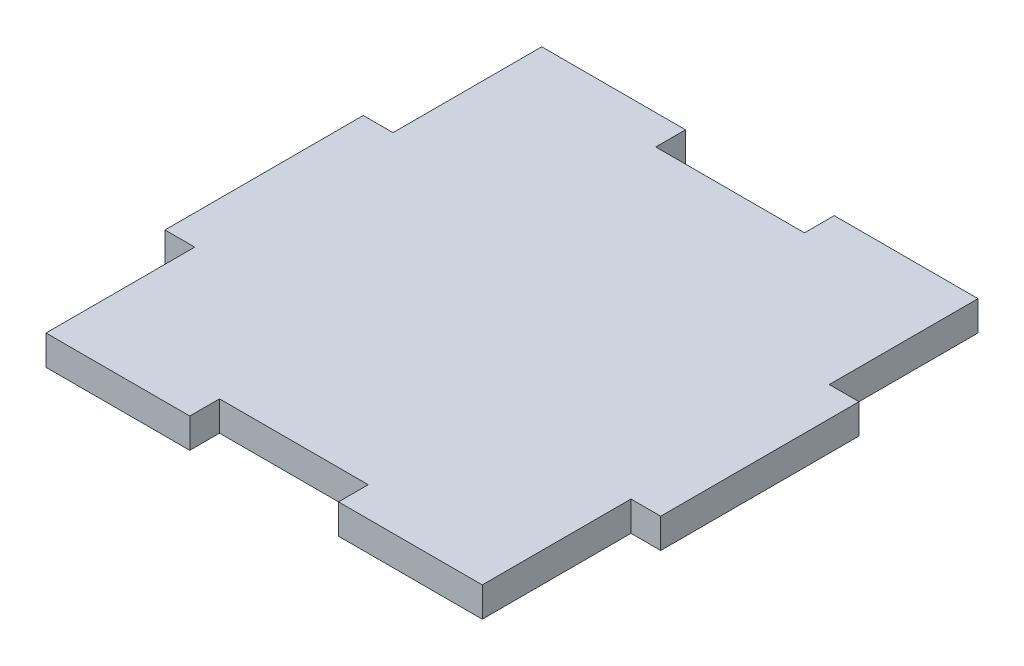
ISO-10303-21;
HEADER;
FILE_DESCRIPTION(('STEP AP214'),'2;1');
FILE_NAME('part.step','',(''),(''),'','','');
FILE_SCHEMA(('AUTOMOTIVE_DESIGN { 1 0 10303 214 1 1 1 1 }'));
ENDSEC;
DATA;
#1=APPLICATION_CONTEXT('core data for automotive mechanical design processes');
#2=APPLICATION_PROTOCOL_DEFINITION('international standard','automotive_design',2000,#1);
#3=PRODUCT_CONTEXT('',#1,'mechanical');
#4=PRODUCT('Part','Part','',(#3));
#5=PRODUCT_RELATED_PRODUCT_CATEGORY('part','',(#4));
#6=PRODUCT_DEFINITION_FORMATION('','',#4);
#7=PRODUCT_DEFINITION_CONTEXT('part definition',#1,'design');
#8=PRODUCT_DEFINITION('design','',#6,#7);
#9=PRODUCT_DEFINITION_SHAPE('','',#8);
#10=(LENGTH_UNIT() NAMED_UNIT(*) SI_UNIT(.MILLI.,.METRE.));
#11=(NAMED_UNIT(*) PLANE_ANGLE_UNIT() SI_UNIT($,.RADIAN.));
#12=(NAMED_UNIT(*) SI_UNIT($,.STERADIAN.) SOLID_ANGLE_UNIT());
#13=UNCERTAINTY_MEASURE_WITH_UNIT(LENGTH_MEASURE(1.E-05),#10,'distance_accuracy_value','');
#14=(GEOMETRIC_REPRESENTATION_CONTEXT(3) GLOBAL_UNCERTAINTY_ASSIGNED_CONTEXT((#13)) GLOBAL_UNIT_ASSIGNED_CONTEXT((#10,
#11,#12)) REPRESENTATION_CONTEXT('',''));
#15=CARTESIAN_POINT('',(0.,0.,0.));
#16=DIRECTION('',(0.,0.,1.));
#17=DIRECTION('',(1.,0.,0.));
#18=AXIS2_PLACEMENT_3D('',#15,#16,#17);
#19=CARTESIAN_POINT('',(22.,3.,-25.));
#20=DIRECTION('',(0.,0.,1.));
#21=DIRECTION('',(1.,0.,0.));
#22=AXIS2_PLACEMENT_3D('',#19,#20,#21);
#23=PLANE('',#22);
#24=DIRECTION('',(-1.,0.,0.));
#25=VECTOR('',#24,1.);
#26=CARTESIAN_POINT('',(22.,0.,-25.));
#27=LINE('',#26,#25);
#28=CARTESIAN_POINT('',(22.,0.,-25.));
#29=VERTEX_POINT('',#28);
#30=CARTESIAN_POINT('',(7.5,0.,-25.));
#31=VERTEX_POINT('',#30);
#32=EDGE_CURVE('E203',#29,#31,#27,.T.);
#33=ORIENTED_EDGE('',*,*,#32,.T.);
#34=DIRECTION('',(0.,-1.,0.));
#35=VECTOR('',#34,1.);
#36=CARTESIAN_POINT('',(7.5,3.,-25.));
#37=LINE('',#36,#35);
#38=CARTESIAN_POINT('',(7.5,3.,-25.));
#39=VERTEX_POINT('',#38);
#40=EDGE_CURVE('E11',#39,#31,#37,.T.);
#41=ORIENTED_EDGE('',*,*,#40,.F.);
#42=DIRECTION('',(-1.,0.,0.));
#43=VECTOR('',#42,1.);
#44=CARTESIAN_POINT('',(22.,3.,-25.));
#45=LINE('',#44,#43);
#46=CARTESIAN_POINT('',(22.,3.,-25.));
#47=VERTEX_POINT('',#46);
#48=EDGE_CURVE('E241',#47,#39,#45,.T.);
#49=ORIENTED_EDGE('',*,*,#48,.F.);
#50=DIRECTION('',(0.,-1.,0.));
#51=VECTOR('',#50,1.);
#52=CARTESIAN_POINT('',(22.,3.,-25.));
#53=LINE('',#52,#51);
#54=EDGE_CURVE('E199',#47,#29,#53,.T.);
#55=ORIENTED_EDGE('',*,*,#54,.T.);
#56=EDGE_LOOP('',(#33,#41,#49,#55));
#57=FACE_BOUND('',#56,.T.);
#58=ADVANCED_FACE('F35',(#57),#23,.F.);
#59=CARTESIAN_POINT('',(7.5,3.,-25.));
#60=DIRECTION('',(1.,0.,0.));
#61=DIRECTION('',(0.,0.,-1.));
#62=AXIS2_PLACEMENT_3D('',#59,#60,#61);
#63=PLANE('',#62);
#64=DIRECTION('',(0.,0.,1.));
#65=VECTOR('',#64,1.);
#66=CARTESIAN_POINT('',(7.5,0.,-25.));
#67=LINE('',#66,#65);
#68=CARTESIAN_POINT('',(7.5,0.,-22.));
#69=VERTEX_POINT('',#68);
#70=EDGE_CURVE('E206',#31,#69,#67,.T.);
#71=ORIENTED_EDGE('',*,*,#70,.T.);
#72=DIRECTION('',(0.,-1.,0.));
#73=VECTOR('',#72,1.);
#74=CARTESIAN_POINT('',(7.5,3.,-22.));
#75=LINE('',#74,#73);
#76=CARTESIAN_POINT('',(7.5,3.,-22.));
#77=VERTEX_POINT('',#76);
#78=EDGE_CURVE('E43',#77,#69,#75,.T.);
#79=ORIENTED_EDGE('',*,*,#78,.F.);
#80=DIRECTION('',(0.,0.,1.));
#81=VECTOR('',#80,1.);
#82=CARTESIAN_POINT('',(7.5,3.,-25.));
#83=LINE('',#82,#81);
#84=EDGE_CURVE('E130',#39,#77,#83,.T.);
#85=ORIENTED_EDGE('',*,*,#84,.F.);
#86=ORIENTED_EDGE('',*,*,#40,.T.);
#87=EDGE_LOOP('',(#71,#79,#85,#86));
#88=FACE_BOUND('',#87,.T.);
#89=ADVANCED_FACE('F359',(#88),#63,.F.);
#90=CARTESIAN_POINT('',(7.5,3.,-22.));
#91=DIRECTION('',(0.,0.,1.));
#92=DIRECTION('',(1.,0.,0.));
#93=AXIS2_PLACEMENT_3D('',#90,#91,#92);
#94=PLANE('',#93);
#95=DIRECTION('',(-1.,0.,0.));
#96=VECTOR('',#95,1.);
#97=CARTESIAN_POINT('',(7.5,0.,-22.));
#98=LINE('',#97,#96);
#99=CARTESIAN_POINT('',(-7.5,0.,-22.));
#100=VERTEX_POINT('',#99);
#101=EDGE_CURVE('E208',#69,#100,#98,.T.);
#102=ORIENTED_EDGE('',*,*,#101,.T.);
#103=DIRECTION('',(0.,-1.,0.));
#104=VECTOR('',#103,1.);
#105=CARTESIAN_POINT('',(-7.5,3.,-22.));
#106=LINE('',#105,#104);
#107=CARTESIAN_POINT('',(-7.5,3.,-22.));
#108=VERTEX_POINT('',#107);
#109=EDGE_CURVE('E284',#108,#100,#106,.T.);
#110=ORIENTED_EDGE('',*,*,#109,.F.);
#111=DIRECTION('',(-1.,0.,0.));
#112=VECTOR('',#111,1.);
#113=CARTESIAN_POINT('',(7.5,3.,-22.));
#114=LINE('',#113,#112);
#115=EDGE_CURVE('E292',#77,#108,#114,.T.);
#116=ORIENTED_EDGE('',*,*,#115,.F.);
#117=ORIENTED_EDGE('',*,*,#78,.T.);
#118=EDGE_LOOP('',(#102,#110,#116,#117));
#119=FACE_BOUND('',#118,.T.);
#120=ADVANCED_FACE('F290',(#119),#94,.F.);
#121=CARTESIAN_POINT('',(-7.5,3.,-25.));
#122=DIRECTION('',(-1.,0.,0.));
#123=DIRECTION('',(0.,0.,1.));
#124=AXIS2_PLACEMENT_3D('',#121,#122,#123);
#125=PLANE('',#124);
#126=DIRECTION('',(0.,0.,-1.));
#127=VECTOR('',#126,1.);
#128=CARTESIAN_POINT('',(-7.5,0.,-25.));
#129=LINE('',#128,#127);
#130=CARTESIAN_POINT('',(-7.5,0.,-25.));
#131=VERTEX_POINT('',#130);
#132=EDGE_CURVE('E210',#100,#131,#129,.T.);
#133=ORIENTED_EDGE('',*,*,#132,.T.);
#134=DIRECTION('',(0.,-1.,0.));
#135=VECTOR('',#134,1.);
#136=CARTESIAN_POINT('',(-7.5,3.,-25.));
#137=LINE('',#136,#135);
#138=CARTESIAN_POINT('',(-7.5,3.,-25.));
#139=VERTEX_POINT('',#138);
#140=EDGE_CURVE('E281',#139,#131,#137,.T.);
#141=ORIENTED_EDGE('',*,*,#140,.F.);
#142=DIRECTION('',(0.,0.,-1.));
#143=VECTOR('',#142,1.);
#144=CARTESIAN_POINT('',(-7.5,3.,-25.));
#145=LINE('',#144,#143);
#146=EDGE_CURVE('E310',#108,#139,#145,.T.);
#147=ORIENTED_EDGE('',*,*,#146,.F.);
#148=ORIENTED_EDGE('',*,*,#109,.T.);
#149=EDGE_LOOP('',(#133,#141,#147,#148));
#150=FACE_BOUND('',#149,.T.);
#151=ADVANCED_FACE('F301',(#150),#125,.F.);
#152=CARTESIAN_POINT('',(-22.,3.,-25.));
#153=DIRECTION('',(0.,0.,1.));
#154=DIRECTION('',(1.,0.,0.));
#155=AXIS2_PLACEMENT_3D('',#152,#153,#154);
#156=PLANE('',#155);
#157=DIRECTION('',(-1.,0.,0.));
#158=VECTOR('',#157,1.);
#159=CARTESIAN_POINT('',(-22.,0.,-25.));
#160=LINE('',#159,#158);
#161=CARTESIAN_POINT('',(-22.,0.,-25.));
#162=VERTEX_POINT('',#161);
#163=EDGE_CURVE('E212',#131,#162,#160,.T.);
#164=ORIENTED_EDGE('',*,*,#163,.T.);
#165=DIRECTION('',(0.,-1.,0.));
#166=VECTOR('',#165,1.);
#167=CARTESIAN_POINT('',(-22.,3.,-25.));
#168=LINE('',#167,#166);
#169=CARTESIAN_POINT('',(-22.,3.,-25.));
#170=VERTEX_POINT('',#169);
#171=EDGE_CURVE('E278',#170,#162,#168,.T.);
#172=ORIENTED_EDGE('',*,*,#171,.F.);
#173=DIRECTION('',(-1.,0.,0.));
#174=VECTOR('',#173,1.);
#175=CARTESIAN_POINT('',(-22.,3.,-25.));
#176=LINE('',#175,#174);
#177=EDGE_CURVE('E307',#139,#170,#176,.T.);
#178=ORIENTED_EDGE('',*,*,#177,.F.);
#179=ORIENTED_EDGE('',*,*,#140,.T.);
#180=EDGE_LOOP('',(#164,#172,#178,#179));
#181=FACE_BOUND('',#180,.T.);
#182=ADVANCED_FACE('F305',(#181),#156,.F.);
#183=CARTESIAN_POINT('',(-22.,3.,-25.));
#184=DIRECTION('',(1.,0.,0.));
#185=DIRECTION('',(0.,0.,-1.));
#186=AXIS2_PLACEMENT_3D('',#183,#184,#185);
#187=PLANE('',#186);
#188=DIRECTION('',(0.,0.,1.));
#189=VECTOR('',#188,1.);
#190=CARTESIAN_POINT('',(-22.,0.,-25.));
#191=LINE('',#190,#189);
#192=CARTESIAN_POINT('',(-22.,0.,-10.));
#193=VERTEX_POINT('',#192);
#194=EDGE_CURVE('E214',#162,#193,#191,.T.);
#195=ORIENTED_EDGE('',*,*,#194,.T.);
#196=DIRECTION('',(0.,-1.,0.));
#197=VECTOR('',#196,1.);
#198=CARTESIAN_POINT('',(-22.,3.,-10.));
#199=LINE('',#198,#197);
#200=CARTESIAN_POINT('',(-22.,3.,-10.));
#201=VERTEX_POINT('',#200);
#202=EDGE_CURVE('E275',#201,#193,#199,.T.);
#203=ORIENTED_EDGE('',*,*,#202,.F.);
#204=DIRECTION('',(0.,0.,1.));
#205=VECTOR('',#204,1.);
#206=CARTESIAN_POINT('',(-22.,3.,-25.));
#207=LINE('',#206,#205);
#208=EDGE_CURVE('E309',#170,#201,#207,.T.);
#209=ORIENTED_EDGE('',*,*,#208,.F.);
#210=ORIENTED_EDGE('',*,*,#171,.T.);
#211=EDGE_LOOP('',(#195,#203,#209,#210));
#212=FACE_BOUND('',#211,.T.);
#213=ADVANCED_FACE('F372',(#212),#187,.F.);
#214=CARTESIAN_POINT('',(-22.,3.,-10.));
#215=DIRECTION('',(0.,0.,1.));
#216=DIRECTION('',(1.,0.,0.));
#217=AXIS2_PLACEMENT_3D('',#214,#215,#216);
#218=PLANE('',#217);
#219=DIRECTION('',(-1.,0.,0.));
#220=VECTOR('',#219,1.);
#221=CARTESIAN_POINT('',(-22.,0.,-10.));
#222=LINE('',#221,#220);
#223=CARTESIAN_POINT('',(-25.,0.,-9.99999999999999));
#224=VERTEX_POINT('',#223);
#225=EDGE_CURVE('E216',#193,#224,#222,.T.);
#226=ORIENTED_EDGE('',*,*,#225,.T.);
#227=DIRECTION('',(0.,-1.,0.));
#228=VECTOR('',#227,1.);
#229=CARTESIAN_POINT('',(-25.,3.,-9.99999999999999));
#230=LINE('',#229,#228);
#231=CARTESIAN_POINT('',(-25.,3.,-9.99999999999999));
#232=VERTEX_POINT('',#231);
#233=EDGE_CURVE('E272',#232,#224,#230,.T.);
#234=ORIENTED_EDGE('',*,*,#233,.F.);
#235=DIRECTION('',(-1.,0.,0.));
#236=VECTOR('',#235,1.);
#237=CARTESIAN_POINT('',(-22.,3.,-10.));
#238=LINE('',#237,#236);
#239=EDGE_CURVE('E312',#201,#232,#238,.T.);
#240=ORIENTED_EDGE('',*,*,#239,.F.);
#241=ORIENTED_EDGE('',*,*,#202,.T.);
#242=EDGE_LOOP('',(#226,#234,#240,#241));
#243=FACE_BOUND('',#242,.T.);
#244=ADVANCED_FACE('F375',(#243),#218,.F.);
#245=CARTESIAN_POINT('',(-25.,3.,-9.99999999999999));
#246=DIRECTION('',(1.,0.,0.));
#247=DIRECTION('',(0.,0.,-1.));
#248=AXIS2_PLACEMENT_3D('',#245,#246,#247);
#249=PLANE('',#248);
#250=DIRECTION('',(0.,0.,1.));
#251=VECTOR('',#250,1.);
#252=CARTESIAN_POINT('',(-25.,0.,-9.99999999999999));
#253=LINE('',#252,#251);
#254=CARTESIAN_POINT('',(-25.,0.,9.99999999999999));
#255=VERTEX_POINT('',#254);
#256=EDGE_CURVE('E218',#224,#255,#253,.T.);
#257=ORIENTED_EDGE('',*,*,#256,.T.);
#258=DIRECTION('',(0.,-1.,0.));
#259=VECTOR('',#258,1.);
#260=CARTESIAN_POINT('',(-25.,3.,9.99999999999999));
#261=LINE('',#260,#259);
#262=CARTESIAN_POINT('',(-25.,3.,9.99999999999999));
#263=VERTEX_POINT('',#262);
#264=EDGE_CURVE('E269',#263,#255,#261,.T.);
#265=ORIENTED_EDGE('',*,*,#264,.F.);
#266=DIRECTION('',(0.,0.,1.));
#267=VECTOR('',#266,1.);
#268=CARTESIAN_POINT('',(-25.,3.,-9.99999999999999));
#269=LINE('',#268,#267);
#270=EDGE_CURVE('E318',#232,#263,#269,.T.);
#271=ORIENTED_EDGE('',*,*,#270,.F.);
#272=ORIENTED_EDGE('',*,*,#233,.T.);
#273=EDGE_LOOP('',(#257,#265,#271,#272));
#274=FACE_BOUND('',#273,.T.);
#275=ADVANCED_FACE('F379',(#274),#249,.F.);
#276=CARTESIAN_POINT('',(-22.,3.,10.));
#277=DIRECTION('',(0.,0.,-1.));
#278=DIRECTION('',(-1.,0.,0.));
#279=AXIS2_PLACEMENT_3D('',#276,#277,#278);
#280=PLANE('',#279);
#281=DIRECTION('',(1.,0.,0.));
#282=VECTOR('',#281,1.);
#283=CARTESIAN_POINT('',(-22.,0.,10.));
#284=LINE('',#283,#282);
#285=CARTESIAN_POINT('',(-22.,0.,10.));
#286=VERTEX_POINT('',#285);
#287=EDGE_CURVE('E220',#255,#286,#284,.T.);
#288=ORIENTED_EDGE('',*,*,#287,.T.);
#289=DIRECTION('',(0.,-1.,0.));
#290=VECTOR('',#289,1.);
#291=CARTESIAN_POINT('',(-22.,3.,10.));
#292=LINE('',#291,#290);
#293=CARTESIAN_POINT('',(-22.,3.,10.));
#294=VERTEX_POINT('',#293);
#295=EDGE_CURVE('E266',#294,#286,#292,.T.);
#296=ORIENTED_EDGE('',*,*,#295,.F.);
#297=DIRECTION('',(1.,0.,0.));
#298=VECTOR('',#297,1.);
#299=CARTESIAN_POINT('',(-22.,3.,10.));
#300=LINE('',#299,#298);
#301=EDGE_CURVE('E320',#263,#294,#300,.T.);
#302=ORIENTED_EDGE('',*,*,#301,.F.);
#303=ORIENTED_EDGE('',*,*,#264,.T.);
#304=EDGE_LOOP('',(#288,#296,#302,#303));
#305=FACE_BOUND('',#304,.T.);
#306=ADVANCED_FACE('F383',(#305),#280,.F.);
#307=CARTESIAN_POINT('',(-22.,3.,25.));
#308=DIRECTION('',(1.,0.,0.));
#309=DIRECTION('',(0.,0.,-1.));
#310=AXIS2_PLACEMENT_3D('',#307,#308,#309);
#311=PLANE('',#310);
#312=DIRECTION('',(0.,0.,1.));
#313=VECTOR('',#312,1.);
#314=CARTESIAN_POINT('',(-22.,0.,25.));
#315=LINE('',#314,#313);
#316=CARTESIAN_POINT('',(-22.,0.,25.));
#317=VERTEX_POINT('',#316);
#318=EDGE_CURVE('E222',#286,#317,#315,.T.);
#319=ORIENTED_EDGE('',*,*,#318,.T.);
#320=DIRECTION('',(0.,-1.,0.));
#321=VECTOR('',#320,1.);
#322=CARTESIAN_POINT('',(-22.,3.,25.));
#323=LINE('',#322,#321);
#324=CARTESIAN_POINT('',(-22.,3.,25.));
#325=VERTEX_POINT('',#324);
#326=EDGE_CURVE('E263',#325,#317,#323,.T.);
#327=ORIENTED_EDGE('',*,*,#326,.F.);
#328=DIRECTION('',(0.,0.,1.));
#329=VECTOR('',#328,1.);
#330=CARTESIAN_POINT('',(-22.,3.,25.));
#331=LINE('',#330,#329);
#332=EDGE_CURVE('E322',#294,#325,#331,.T.);
#333=ORIENTED_EDGE('',*,*,#332,.F.);
#334=ORIENTED_EDGE('',*,*,#295,.T.);
#335=EDGE_LOOP('',(#319,#327,#333,#334));
#336=FACE_BOUND('',#335,.T.);
#337=ADVANCED_FACE('F387',(#336),#311,.F.);
#338=CARTESIAN_POINT('',(-22.,3.,25.));
#339=DIRECTION('',(0.,0.,-1.));
#340=DIRECTION('',(-1.,0.,0.));
#341=AXIS2_PLACEMENT_3D('',#338,#339,#340);
#342=PLANE('',#341);
#343=DIRECTION('',(1.,0.,0.));
#344=VECTOR('',#343,1.);
#345=CARTESIAN_POINT('',(-22.,0.,25.));
#346=LINE('',#345,#344);
#347=CARTESIAN_POINT('',(-7.5,0.,25.));
#348=VERTEX_POINT('',#347);
#349=EDGE_CURVE('E224',#317,#348,#346,.T.);
#350=ORIENTED_EDGE('',*,*,#349,.T.);
#351=DIRECTION('',(0.,-1.,0.));
#352=VECTOR('',#351,1.);
#353=CARTESIAN_POINT('',(-7.5,3.,25.));
#354=LINE('',#353,#352);
#355=CARTESIAN_POINT('',(-7.5,3.,25.));
#356=VERTEX_POINT('',#355);
#357=EDGE_CURVE('E260',#356,#348,#354,.T.);
#358=ORIENTED_EDGE('',*,*,#357,.F.);
#359=DIRECTION('',(1.,0.,0.));
#360=VECTOR('',#359,1.);
#361=CARTESIAN_POINT('',(-22.,3.,25.));
#362=LINE('',#361,#360);
#363=EDGE_CURVE('E324',#325,#356,#362,.T.);
#364=ORIENTED_EDGE('',*,*,#363,.F.);
#365=ORIENTED_EDGE('',*,*,#326,.T.);
#366=EDGE_LOOP('',(#350,#358,#364,#365));
#367=FACE_BOUND('',#366,.T.);
#368=ADVANCED_FACE('F391',(#367),#342,.F.);
#369=CARTESIAN_POINT('',(-7.5,3.,25.));
#370=DIRECTION('',(-1.,0.,0.));
#371=DIRECTION('',(0.,0.,1.));
#372=AXIS2_PLACEMENT_3D('',#369,#370,#371);
#373=PLANE('',#372);
#374=DIRECTION('',(0.,0.,-1.));
#375=VECTOR('',#374,1.);
#376=CARTESIAN_POINT('',(-7.5,0.,25.));
#377=LINE('',#376,#375);
#378=CARTESIAN_POINT('',(-7.5,0.,22.));
#379=VERTEX_POINT('',#378);
#380=EDGE_CURVE('E226',#348,#379,#377,.T.);
#381=ORIENTED_EDGE('',*,*,#380,.T.);
#382=DIRECTION('',(0.,-1.,0.));
#383=VECTOR('',#382,1.);
#384=CARTESIAN_POINT('',(-7.5,3.,22.));
#385=LINE('',#384,#383);
#386=CARTESIAN_POINT('',(-7.5,3.,22.));
#387=VERTEX_POINT('',#386);
#388=EDGE_CURVE('E257',#387,#379,#385,.T.);
#389=ORIENTED_EDGE('',*,*,#388,.F.);
#390=DIRECTION('',(0.,0.,-1.));
#391=VECTOR('',#390,1.);
#392=CARTESIAN_POINT('',(-7.5,3.,25.));
#393=LINE('',#392,#391);
#394=EDGE_CURVE('E326',#356,#387,#393,.T.);
#395=ORIENTED_EDGE('',*,*,#394,.F.);
#396=ORIENTED_EDGE('',*,*,#357,.T.);
#397=EDGE_LOOP('',(#381,#389,#395,#396));
#398=FACE_BOUND('',#397,.T.);
#399=ADVANCED_FACE('F395',(#398),#373,.F.);
#400=CARTESIAN_POINT('',(7.5,3.,22.));
#401=DIRECTION('',(0.,0.,-1.));
#402=DIRECTION('',(-1.,0.,0.));
#403=AXIS2_PLACEMENT_3D('',#400,#401,#402);
#404=PLANE('',#403);
#405=DIRECTION('',(1.,0.,0.));
#406=VECTOR('',#405,1.);
#407=CARTESIAN_POINT('',(7.5,0.,22.));
#408=LINE('',#407,#406);
#409=CARTESIAN_POINT('',(7.5,0.,22.));
#410=VERTEX_POINT('',#409);
#411=EDGE_CURVE('E228',#379,#410,#408,.T.);
#412=ORIENTED_EDGE('',*,*,#411,.T.);
#413=DIRECTION('',(0.,-1.,0.));
#414=VECTOR('',#413,1.);
#415=CARTESIAN_POINT('',(7.5,3.,22.));
#416=LINE('',#415,#414);
#417=CARTESIAN_POINT('',(7.5,3.,22.));
#418=VERTEX_POINT('',#417);
#419=EDGE_CURVE('E254',#418,#410,#416,.T.);
#420=ORIENTED_EDGE('',*,*,#419,.F.);
#421=DIRECTION('',(1.,0.,0.));
#422=VECTOR('',#421,1.);
#423=CARTESIAN_POINT('',(7.5,3.,22.));
#424=LINE('',#423,#422);
#425=EDGE_CURVE('E328',#387,#418,#424,.T.);
#426=ORIENTED_EDGE('',*,*,#425,.F.);
#427=ORIENTED_EDGE('',*,*,#388,.T.);
#428=EDGE_LOOP('',(#412,#420,#426,#427));
#429=FACE_BOUND('',#428,.T.);
#430=ADVANCED_FACE('F399',(#429),#404,.F.);
#431=CARTESIAN_POINT('',(7.5,3.,25.));
#432=DIRECTION('',(1.,0.,0.));
#433=DIRECTION('',(0.,0.,-1.));
#434=AXIS2_PLACEMENT_3D('',#431,#432,#433);
#435=PLANE('',#434);
#436=DIRECTION('',(0.,0.,1.));
#437=VECTOR('',#436,1.);
#438=CARTESIAN_POINT('',(7.5,0.,25.));
#439=LINE('',#438,#437);
#440=CARTESIAN_POINT('',(7.5,0.,25.));
#441=VERTEX_POINT('',#440);
#442=EDGE_CURVE('E230',#410,#441,#439,.T.);
#443=ORIENTED_EDGE('',*,*,#442,.T.);
#444=DIRECTION('',(0.,-1.,0.));
#445=VECTOR('',#444,1.);
#446=CARTESIAN_POINT('',(7.5,3.,25.));
#447=LINE('',#446,#445);
#448=CARTESIAN_POINT('',(7.5,3.,25.));
#449=VERTEX_POINT('',#448);
#450=EDGE_CURVE('E251',#449,#441,#447,.T.);
#451=ORIENTED_EDGE('',*,*,#450,.F.);
#452=DIRECTION('',(0.,0.,1.));
#453=VECTOR('',#452,1.);
#454=CARTESIAN_POINT('',(7.5,3.,25.));
#455=LINE('',#454,#453);
#456=EDGE_CURVE('E330',#418,#449,#455,.T.);
#457=ORIENTED_EDGE('',*,*,#456,.F.);
#458=ORIENTED_EDGE('',*,*,#419,.T.);
#459=EDGE_LOOP('',(#443,#451,#457,#458));
#460=FACE_BOUND('',#459,.T.);
#461=ADVANCED_FACE('F403',(#460),#435,.F.);
#462=CARTESIAN_POINT('',(22.,3.,25.));
#463=DIRECTION('',(0.,0.,-1.));
#464=DIRECTION('',(-1.,0.,0.));
#465=AXIS2_PLACEMENT_3D('',#462,#463,#464);
#466=PLANE('',#465);
#467=DIRECTION('',(1.,0.,0.));
#468=VECTOR('',#467,1.);
#469=CARTESIAN_POINT('',(22.,0.,25.));
#470=LINE('',#469,#468);
#471=CARTESIAN_POINT('',(22.,0.,25.));
#472=VERTEX_POINT('',#471);
#473=EDGE_CURVE('E232',#441,#472,#470,.T.);
#474=ORIENTED_EDGE('',*,*,#473,.T.);
#475=DIRECTION('',(0.,-1.,0.));
#476=VECTOR('',#475,1.);
#477=CARTESIAN_POINT('',(22.,3.,25.));
#478=LINE('',#477,#476);
#479=CARTESIAN_POINT('',(22.,3.,25.));
#480=VERTEX_POINT('',#479);
#481=EDGE_CURVE('E248',#480,#472,#478,.T.);
#482=ORIENTED_EDGE('',*,*,#481,.F.);
#483=DIRECTION('',(1.,0.,0.));
#484=VECTOR('',#483,1.);
#485=CARTESIAN_POINT('',(22.,3.,25.));
#486=LINE('',#485,#484);
#487=EDGE_CURVE('E332',#449,#480,#486,.T.);
#488=ORIENTED_EDGE('',*,*,#487,.F.);
#489=ORIENTED_EDGE('',*,*,#450,.T.);
#490=EDGE_LOOP('',(#474,#482,#488,#489));
#491=FACE_BOUND('',#490,.T.);
#492=ADVANCED_FACE('F407',(#491),#466,.F.);
#493=CARTESIAN_POINT('',(22.,3.,25.));
#494=DIRECTION('',(-1.,0.,0.));
#495=DIRECTION('',(0.,0.,1.));
#496=AXIS2_PLACEMENT_3D('',#493,#494,#495);
#497=PLANE('',#496);
#498=DIRECTION('',(0.,0.,-1.));
#499=VECTOR('',#498,1.);
#500=CARTESIAN_POINT('',(22.,0.,25.));
#501=LINE('',#500,#499);
#502=CARTESIAN_POINT('',(22.,0.,10.));
#503=VERTEX_POINT('',#502);
#504=EDGE_CURVE('E234',#472,#503,#501,.T.);
#505=ORIENTED_EDGE('',*,*,#504,.T.);
#506=DIRECTION('',(0.,-1.,0.));
#507=VECTOR('',#506,1.);
#508=CARTESIAN_POINT('',(22.,3.,10.));
#509=LINE('',#508,#507);
#510=CARTESIAN_POINT('',(22.,3.,10.));
#511=VERTEX_POINT('',#510);
#512=EDGE_CURVE('E245',#511,#503,#509,.T.);
#513=ORIENTED_EDGE('',*,*,#512,.F.);
#514=DIRECTION('',(0.,0.,-1.));
#515=VECTOR('',#514,1.);
#516=CARTESIAN_POINT('',(22.,3.,25.));
#517=LINE('',#516,#515);
#518=EDGE_CURVE('E334',#480,#511,#517,.T.);
#519=ORIENTED_EDGE('',*,*,#518,.F.);
#520=ORIENTED_EDGE('',*,*,#481,.T.);
#521=EDGE_LOOP('',(#505,#513,#519,#520));
#522=FACE_BOUND('',#521,.T.);
#523=ADVANCED_FACE('F340',(#522),#497,.F.);
#524=CARTESIAN_POINT('',(22.,3.,10.));
#525=DIRECTION('',(0.,0.,-1.));
#526=DIRECTION('',(-1.,0.,0.));
#527=AXIS2_PLACEMENT_3D('',#524,#525,#526);
#528=PLANE('',#527);
#529=DIRECTION('',(1.,0.,0.));
#530=VECTOR('',#529,1.);
#531=CARTESIAN_POINT('',(22.,0.,10.));
#532=LINE('',#531,#530);
#533=CARTESIAN_POINT('',(25.,0.,9.99999999999999));
#534=VERTEX_POINT('',#533);
#535=EDGE_CURVE('E236',#503,#534,#532,.T.);
#536=ORIENTED_EDGE('',*,*,#535,.T.);
#537=DIRECTION('',(0.,-1.,0.));
#538=VECTOR('',#537,1.);
#539=CARTESIAN_POINT('',(25.,3.,9.99999999999999));
#540=LINE('',#539,#538);
#541=CARTESIAN_POINT('',(25.,3.,9.99999999999999));
#542=VERTEX_POINT('',#541);
#543=EDGE_CURVE('E194',#542,#534,#540,.T.);
#544=ORIENTED_EDGE('',*,*,#543,.F.);
#545=DIRECTION('',(1.,0.,0.));
#546=VECTOR('',#545,1.);
#547=CARTESIAN_POINT('',(22.,3.,10.));
#548=LINE('',#547,#546);
#549=EDGE_CURVE('E185',#511,#542,#548,.T.);
#550=ORIENTED_EDGE('',*,*,#549,.F.);
#551=ORIENTED_EDGE('',*,*,#512,.T.);
#552=EDGE_LOOP('',(#536,#544,#550,#551));
#553=FACE_BOUND('',#552,.T.);
#554=ADVANCED_FACE('F344',(#553),#528,.F.);
#555=CARTESIAN_POINT('',(25.,3.,-9.99999999999999));
#556=DIRECTION('',(-1.,0.,0.));
#557=DIRECTION('',(0.,0.,1.));
#558=AXIS2_PLACEMENT_3D('',#555,#556,#557);
#559=PLANE('',#558);
#560=DIRECTION('',(0.,0.,-1.));
#561=VECTOR('',#560,1.);
#562=CARTESIAN_POINT('',(25.,0.,-9.99999999999999));
#563=LINE('',#562,#561);
#564=CARTESIAN_POINT('',(25.,0.,-9.99999999999999));
#565=VERTEX_POINT('',#564);
#566=EDGE_CURVE('E193',#534,#565,#563,.T.);
#567=ORIENTED_EDGE('',*,*,#566,.T.);
#568=DIRECTION('',(0.,-1.,0.));
#569=VECTOR('',#568,1.);
#570=CARTESIAN_POINT('',(25.,3.,-9.99999999999999));
#571=LINE('',#570,#569);
#572=CARTESIAN_POINT('',(25.,3.,-9.99999999999999));
#573=VERTEX_POINT('',#572);
#574=EDGE_CURVE('E190',#573,#565,#571,.T.);
#575=ORIENTED_EDGE('',*,*,#574,.F.);
#576=DIRECTION('',(0.,0.,-1.));
#577=VECTOR('',#576,1.);
#578=CARTESIAN_POINT('',(25.,3.,-9.99999999999999));
#579=LINE('',#578,#577);
#580=EDGE_CURVE('E179',#542,#573,#579,.T.);
#581=ORIENTED_EDGE('',*,*,#580,.F.);
#582=ORIENTED_EDGE('',*,*,#543,.T.);
#583=EDGE_LOOP('',(#567,#575,#581,#582));
#584=FACE_BOUND('',#583,.T.);
#585=ADVANCED_FACE('F191',(#584),#559,.F.);
#586=CARTESIAN_POINT('',(22.,3.,-10.));
#587=DIRECTION('',(0.,0.,1.));
#588=DIRECTION('',(1.,0.,0.));
#589=AXIS2_PLACEMENT_3D('',#586,#587,#588);
#590=PLANE('',#589);
#591=DIRECTION('',(-1.,0.,0.));
#592=VECTOR('',#591,1.);
#593=CARTESIAN_POINT('',(22.,0.,-10.));
#594=LINE('',#593,#592);
#595=CARTESIAN_POINT('',(22.,0.,-10.));
#596=VERTEX_POINT('',#595);
#597=EDGE_CURVE('E116',#565,#596,#594,.T.);
#598=ORIENTED_EDGE('',*,*,#597,.T.);
#599=DIRECTION('',(0.,-1.,0.));
#600=VECTOR('',#599,1.);
#601=CARTESIAN_POINT('',(22.,3.,-10.));
#602=LINE('',#601,#600);
#603=CARTESIAN_POINT('',(22.,3.,-10.));
#604=VERTEX_POINT('',#603);
#605=EDGE_CURVE('E195',#604,#596,#602,.T.);
#606=ORIENTED_EDGE('',*,*,#605,.F.);
#607=DIRECTION('',(-1.,0.,0.));
#608=VECTOR('',#607,1.);
#609=CARTESIAN_POINT('',(22.,3.,-10.));
#610=LINE('',#609,#608);
#611=EDGE_CURVE('E183',#573,#604,#610,.T.);
#612=ORIENTED_EDGE('',*,*,#611,.F.);
#613=ORIENTED_EDGE('',*,*,#574,.T.);
#614=EDGE_LOOP('',(#598,#606,#612,#613));
#615=FACE_BOUND('',#614,.T.);
#616=ADVANCED_FACE('F197',(#615),#590,.F.);
#617=CARTESIAN_POINT('',(22.,3.,-25.));
#618=DIRECTION('',(-1.,0.,0.));
#619=DIRECTION('',(0.,0.,1.));
#620=AXIS2_PLACEMENT_3D('',#617,#618,#619);
#621=PLANE('',#620);
#622=DIRECTION('',(0.,0.,-1.));
#623=VECTOR('',#622,1.);
#624=CARTESIAN_POINT('',(22.,0.,-25.));
#625=LINE('',#624,#623);
#626=EDGE_CURVE('E122',#596,#29,#625,.T.);
#627=ORIENTED_EDGE('',*,*,#626,.T.);
#628=ORIENTED_EDGE('',*,*,#54,.F.);
#629=DIRECTION('',(0.,0.,-1.));
#630=VECTOR('',#629,1.);
#631=CARTESIAN_POINT('',(22.,3.,-25.));
#632=LINE('',#631,#630);
#633=EDGE_CURVE('E51',#604,#47,#632,.T.);
#634=ORIENTED_EDGE('',*,*,#633,.F.);
#635=ORIENTED_EDGE('',*,*,#605,.T.);
#636=EDGE_LOOP('',(#627,#628,#634,#635));
#637=FACE_BOUND('',#636,.T.);
#638=ADVANCED_FACE('F348',(#637),#621,.F.);
#639=CARTESIAN_POINT('',(0.,3.,0.));
#640=DIRECTION('',(0.,1.,0.));
#641=DIRECTION('',(0.,0.,1.));
#642=AXIS2_PLACEMENT_3D('',#639,#640,#641);
#643=PLANE('',#642);
#644=ORIENTED_EDGE('',*,*,#48,.T.);
#645=ORIENTED_EDGE('',*,*,#84,.T.);
#646=ORIENTED_EDGE('',*,*,#115,.T.);
#647=ORIENTED_EDGE('',*,*,#146,.T.);
#648=ORIENTED_EDGE('',*,*,#177,.T.);
#649=ORIENTED_EDGE('',*,*,#208,.T.);
#650=ORIENTED_EDGE('',*,*,#239,.T.);
#651=ORIENTED_EDGE('',*,*,#270,.T.);
#652=ORIENTED_EDGE('',*,*,#301,.T.);
#653=ORIENTED_EDGE('',*,*,#332,.T.);
#654=ORIENTED_EDGE('',*,*,#363,.T.);
#655=ORIENTED_EDGE('',*,*,#394,.T.);
#656=ORIENTED_EDGE('',*,*,#425,.T.);
#657=ORIENTED_EDGE('',*,*,#456,.T.);
#658=ORIENTED_EDGE('',*,*,#487,.T.);
#659=ORIENTED_EDGE('',*,*,#518,.T.);
#660=ORIENTED_EDGE('',*,*,#549,.T.);
#661=ORIENTED_EDGE('',*,*,#580,.T.);
#662=ORIENTED_EDGE('',*,*,#611,.T.);
#663=ORIENTED_EDGE('',*,*,#633,.T.);
#664=EDGE_LOOP('',(#644,#645,#646,#647,#648,#649,#650,#651,#652,#653,#654,#655,#656,#657,#658,
#659,#660,#661,#662,#663));
#665=FACE_BOUND('',#664,.T.);
#666=ADVANCED_FACE('F181',(#665),#643,.T.);
#667=CARTESIAN_POINT('',(0.,0.,0.));
#668=DIRECTION('',(0.,1.,0.));
#669=DIRECTION('',(0.,0.,1.));
#670=AXIS2_PLACEMENT_3D('',#667,#668,#669);
#671=PLANE('',#670);
#672=ORIENTED_EDGE('',*,*,#32,.F.);
#673=ORIENTED_EDGE('',*,*,#626,.F.);
#674=ORIENTED_EDGE('',*,*,#597,.F.);
#675=ORIENTED_EDGE('',*,*,#566,.F.);
#676=ORIENTED_EDGE('',*,*,#535,.F.);
#677=ORIENTED_EDGE('',*,*,#504,.F.);
#678=ORIENTED_EDGE('',*,*,#473,.F.);
#679=ORIENTED_EDGE('',*,*,#442,.F.);
#680=ORIENTED_EDGE('',*,*,#411,.F.);
#681=ORIENTED_EDGE('',*,*,#380,.F.);
#682=ORIENTED_EDGE('',*,*,#349,.F.);
#683=ORIENTED_EDGE('',*,*,#318,.F.);
#684=ORIENTED_EDGE('',*,*,#287,.F.);
#685=ORIENTED_EDGE('',*,*,#256,.F.);
#686=ORIENTED_EDGE('',*,*,#225,.F.);
#687=ORIENTED_EDGE('',*,*,#194,.F.);
#688=ORIENTED_EDGE('',*,*,#163,.F.);
#689=ORIENTED_EDGE('',*,*,#132,.F.);
#690=ORIENTED_EDGE('',*,*,#101,.F.);
#691=ORIENTED_EDGE('',*,*,#70,.F.);
#692=EDGE_LOOP('',(#672,#673,#674,#675,#676,#677,#678,#679,#680,#681,#682,#683,#684,#685,#686,
#687,#688,#689,#690,#691));
#693=FACE_BOUND('',#692,.T.);
#694=ADVANCED_FACE('F296',(#693),#671,.F.);
#695=CLOSED_SHELL('',(#58,#89,#120,#151,#182,#213,#244,#275,#306,#337,#368,#399,#430,#461,#492,
#523,#554,#585,#616,#638,#666,#694));
#696=MANIFOLD_SOLID_BREP('B2',#695);
#697=ADVANCED_BREP_SHAPE_REPRESENTATION('',(#18,#696),#14);
#698=SHAPE_DEFINITION_REPRESENTATION(#9,#697);
ENDSEC;
END-ISO-10303-21;
